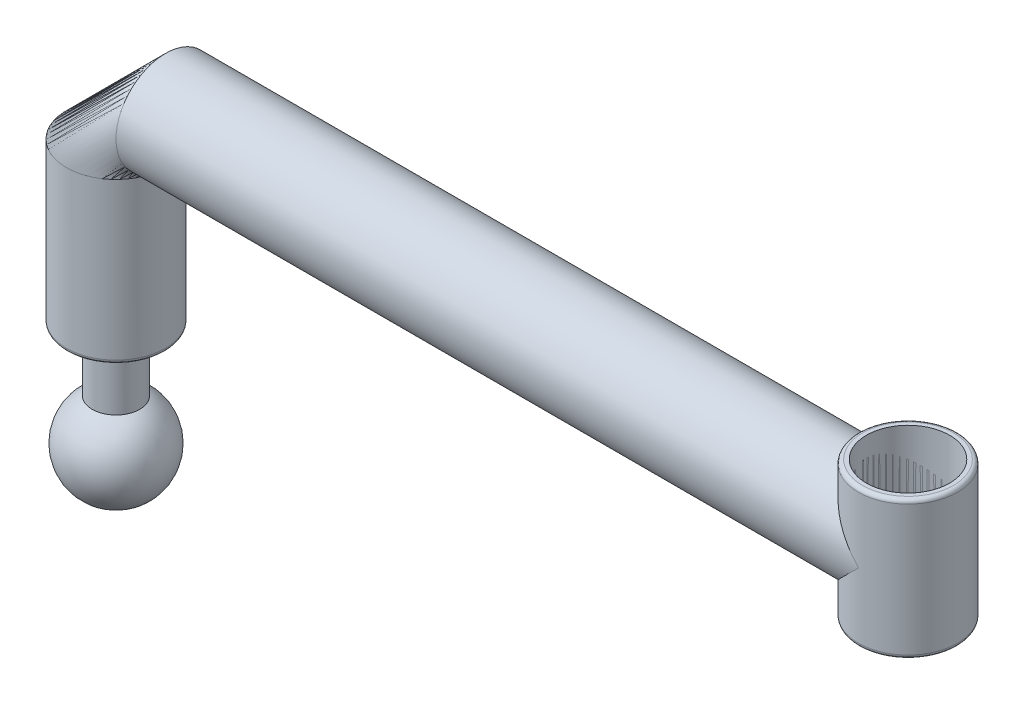
ISO-10303-21;
HEADER;
FILE_DESCRIPTION(('STEP AP214'),'2;1');
FILE_NAME('part.step','',(''),(''),'','','');
FILE_SCHEMA(('AUTOMOTIVE_DESIGN { 1 0 10303 214 1 1 1 1 }'));
ENDSEC;
DATA;
#1=APPLICATION_CONTEXT('core data for automotive mechanical design processes');
#2=APPLICATION_PROTOCOL_DEFINITION('international standard','automotive_design',2000,#1);
#3=PRODUCT_CONTEXT('',#1,'mechanical');
#4=PRODUCT('Part','Part','',(#3));
#5=PRODUCT_RELATED_PRODUCT_CATEGORY('part','',(#4));
#6=PRODUCT_DEFINITION_FORMATION('','',#4);
#7=PRODUCT_DEFINITION_CONTEXT('part definition',#1,'design');
#8=PRODUCT_DEFINITION('design','',#6,#7);
#9=PRODUCT_DEFINITION_SHAPE('','',#8);
#10=(LENGTH_UNIT() NAMED_UNIT(*) SI_UNIT(.MILLI.,.METRE.));
#11=(NAMED_UNIT(*) PLANE_ANGLE_UNIT() SI_UNIT($,.RADIAN.));
#12=(NAMED_UNIT(*) SI_UNIT($,.STERADIAN.) SOLID_ANGLE_UNIT());
#13=UNCERTAINTY_MEASURE_WITH_UNIT(LENGTH_MEASURE(1.E-05),#10,'distance_accuracy_value','');
#14=(GEOMETRIC_REPRESENTATION_CONTEXT(3) GLOBAL_UNCERTAINTY_ASSIGNED_CONTEXT((#13)) GLOBAL_UNIT_ASSIGNED_CONTEXT((#10,
#11,#12)) REPRESENTATION_CONTEXT('',''));
#15=CARTESIAN_POINT('',(0.,0.,0.));
#16=DIRECTION('',(0.,0.,1.));
#17=DIRECTION('',(1.,0.,0.));
#18=AXIS2_PLACEMENT_3D('',#15,#16,#17);
#19=CARTESIAN_POINT('',(200.,79.,0.));
#20=DIRECTION('',(0.,1.,0.));
#21=DIRECTION('',(0.,0.,1.));
#22=AXIS2_PLACEMENT_3D('',#19,#20,#21);
#23=CYLINDRICAL_SURFACE('',#22,12.5);
#24=CARTESIAN_POINT('',(200.,95.5,0.));
#25=DIRECTION('',(0.,1.,0.));
#26=DIRECTION('',(0.,0.,1.));
#27=AXIS2_PLACEMENT_3D('',#24,#25,#26);
#28=CIRCLE('',#27,12.5);
#29=CARTESIAN_POINT('',(200.,95.5,12.5));
#30=VERTEX_POINT('',#29);
#31=EDGE_CURVE('E48',#30,#30,#28,.F.);
#32=ORIENTED_EDGE('',*,*,#31,.T.);
#33=EDGE_LOOP('',(#32));
#34=FACE_BOUND('',#33,.T.);
#35=CARTESIAN_POINT('',(200.,62.5,0.));
#36=DIRECTION('',(0.,1.,0.));
#37=DIRECTION('',(0.,0.,1.));
#38=AXIS2_PLACEMENT_3D('',#35,#36,#37);
#39=CIRCLE('',#38,12.5);
#40=CARTESIAN_POINT('',(200.,62.5,12.5));
#41=VERTEX_POINT('',#40);
#42=EDGE_CURVE('E52',#41,#41,#39,.T.);
#43=ORIENTED_EDGE('',*,*,#42,.T.);
#44=EDGE_LOOP('',(#43));
#45=FACE_BOUND('',#44,.T.);
#46=ADVANCED_FACE('F41',(#34,#45),#23,.T.);
#47=CARTESIAN_POINT('',(200.,61.5,0.));
#48=DIRECTION('',(0.,1.,0.));
#49=DIRECTION('',(0.,0.,1.));
#50=AXIS2_PLACEMENT_3D('',#47,#48,#49);
#51=PLANE('',#50);
#52=CARTESIAN_POINT('',(200.,61.5,0.));
#53=DIRECTION('',(0.,1.,0.));
#54=DIRECTION('',(0.,0.,1.));
#55=AXIS2_PLACEMENT_3D('',#52,#53,#54);
#56=CIRCLE('',#55,11.5);
#57=CARTESIAN_POINT('',(200.,61.5,11.5));
#58=VERTEX_POINT('',#57);
#59=EDGE_CURVE('E11',#58,#58,#56,.F.);
#60=ORIENTED_EDGE('',*,*,#59,.T.);
#61=EDGE_LOOP('',(#60));
#62=FACE_BOUND('',#61,.T.);
#63=ADVANCED_FACE('F81',(#62),#51,.F.);
#64=CARTESIAN_POINT('',(200.,96.5,0.));
#65=DIRECTION('',(0.,1.,0.));
#66=DIRECTION('',(0.,0.,1.));
#67=AXIS2_PLACEMENT_3D('',#64,#65,#66);
#68=PLANE('',#67);
#69=CARTESIAN_POINT('',(200.,96.5,0.));
#70=DIRECTION('',(0.,1.,0.));
#71=DIRECTION('',(0.,0.,1.));
#72=AXIS2_PLACEMENT_3D('',#69,#70,#71);
#73=CIRCLE('',#72,11.5);
#74=CARTESIAN_POINT('',(200.,96.5,11.5));
#75=VERTEX_POINT('',#74);
#76=EDGE_CURVE('E56',#75,#75,#73,.T.);
#77=ORIENTED_EDGE('',*,*,#76,.T.);
#78=EDGE_LOOP('',(#77));
#79=FACE_BOUND('',#78,.T.);
#80=CARTESIAN_POINT('',(200.,96.5,0.));
#81=DIRECTION('',(0.,1.,0.));
#82=DIRECTION('',(0.,0.,1.));
#83=AXIS2_PLACEMENT_3D('',#80,#81,#82);
#84=CIRCLE('',#83,10.5);
#85=CARTESIAN_POINT('',(200.,96.5,10.5));
#86=VERTEX_POINT('',#85);
#87=EDGE_CURVE('E62',#86,#86,#84,.T.);
#88=ORIENTED_EDGE('',*,*,#87,.F.);
#89=EDGE_LOOP('',(#88));
#90=FACE_BOUND('',#89,.T.);
#91=ADVANCED_FACE('F72',(#79,#90),#68,.T.);
#92=CARTESIAN_POINT('',(200.,79.,0.));
#93=DIRECTION('',(0.,1.,0.));
#94=DIRECTION('',(0.,0.,1.));
#95=AXIS2_PLACEMENT_3D('',#92,#93,#94);
#96=CYLINDRICAL_SURFACE('',#95,10.5);
#97=ORIENTED_EDGE('',*,*,#87,.T.);
#98=EDGE_LOOP('',(#97));
#99=FACE_BOUND('',#98,.T.);
#100=CARTESIAN_POINT('',(200.,63.5,0.));
#101=DIRECTION('',(0.,1.,0.));
#102=DIRECTION('',(0.,0.,1.));
#103=AXIS2_PLACEMENT_3D('',#100,#101,#102);
#104=CIRCLE('',#103,10.5);
#105=CARTESIAN_POINT('',(200.,63.5,10.5));
#106=VERTEX_POINT('',#105);
#107=EDGE_CURVE('E61',#106,#106,#104,.T.);
#108=ORIENTED_EDGE('',*,*,#107,.F.);
#109=EDGE_LOOP('',(#108));
#110=FACE_BOUND('',#109,.T.);
#111=ADVANCED_FACE('F70',(#99,#110),#96,.F.);
#112=CARTESIAN_POINT('',(200.,63.5,0.));
#113=DIRECTION('',(0.,1.,0.));
#114=DIRECTION('',(0.,0.,1.));
#115=AXIS2_PLACEMENT_3D('',#112,#113,#114);
#116=PLANE('',#115);
#117=ORIENTED_EDGE('',*,*,#107,.T.);
#118=EDGE_LOOP('',(#117));
#119=FACE_BOUND('',#118,.T.);
#120=ADVANCED_FACE('F68',(#119),#116,.T.);
#121=CARTESIAN_POINT('',(200.,95.5,0.));
#122=DIRECTION('',(0.,1.,0.));
#123=DIRECTION('',(0.,0.,1.));
#124=AXIS2_PLACEMENT_3D('',#121,#122,#123);
#125=TOROIDAL_SURFACE('',#124,11.5,1.);
#126=ORIENTED_EDGE('',*,*,#31,.F.);
#127=EDGE_LOOP('',(#126));
#128=FACE_BOUND('',#127,.T.);
#129=ORIENTED_EDGE('',*,*,#76,.F.);
#130=EDGE_LOOP('',(#129));
#131=FACE_BOUND('',#130,.T.);
#132=ADVANCED_FACE('F79',(#128,#131),#125,.T.);
#133=CARTESIAN_POINT('',(200.,62.5,0.));
#134=DIRECTION('',(0.,1.,0.));
#135=DIRECTION('',(0.,0.,1.));
#136=AXIS2_PLACEMENT_3D('',#133,#134,#135);
#137=TOROIDAL_SURFACE('',#136,11.5,1.);
#138=ORIENTED_EDGE('',*,*,#59,.F.);
#139=EDGE_LOOP('',(#138));
#140=FACE_BOUND('',#139,.T.);
#141=ORIENTED_EDGE('',*,*,#42,.F.);
#142=EDGE_LOOP('',(#141));
#143=FACE_BOUND('',#142,.T.);
#144=ADVANCED_FACE('F43',(#140,#143),#137,.T.);
#145=CLOSED_SHELL('',(#46,#63,#91,#111,#120,#132,#144));
#146=MANIFOLD_SOLID_BREP('B2',#145);
#147=CARTESIAN_POINT('',(12.5,79.,0.));
#148=DIRECTION('',(1.,0.,0.));
#149=DIRECTION('',(0.,1.,0.));
#150=AXIS2_PLACEMENT_3D('',#147,#148,#149);
#151=CYLINDRICAL_SURFACE('',#150,12.5);
#152=CARTESIAN_POINT('',(12.5,79.,0.));
#153=DIRECTION('',(1.,0.,0.));
#154=DIRECTION('',(0.,0.,1.));
#155=AXIS2_PLACEMENT_3D('',#152,#153,#154);
#156=CIRCLE('',#155,12.5);
#157=CARTESIAN_POINT('',(12.5,66.5,0.));
#158=VERTEX_POINT('',#157);
#159=EDGE_CURVE('E175',#158,#158,#156,.T.);
#160=ORIENTED_EDGE('',*,*,#159,.T.);
#161=EDGE_LOOP('',(#160));
#162=FACE_BOUND('',#161,.T.);
#163=CARTESIAN_POINT('',(200.,79.,0.));
#164=DIRECTION('',(1.,0.,0.));
#165=DIRECTION('',(0.,0.,1.));
#166=AXIS2_PLACEMENT_3D('',#163,#164,#165);
#167=CIRCLE('',#166,12.5);
#168=CARTESIAN_POINT('',(200.,85.7823299831253,10.5));
#169=VERTEX_POINT('',#168);
#170=CARTESIAN_POINT('',(200.,72.2176700168747,10.5));
#171=VERTEX_POINT('',#170);
#172=EDGE_CURVE('E197',#169,#171,#167,.T.);
#173=ORIENTED_EDGE('',*,*,#172,.F.);
#174=CARTESIAN_POINT('',(200.,85.7823299831253,10.5));
#175=CARTESIAN_POINT('',(199.814885205617,85.782193180428,10.5000442332341));
#176=CARTESIAN_POINT('',(199.629856733377,85.7899052341444,10.4951067566132));
#177=CARTESIAN_POINT('',(199.261856361922,85.819955079881,10.4756276433661));
#178=CARTESIAN_POINT('',(199.078881116329,85.8422638854892,10.4611050405055));
#179=CARTESIAN_POINT('',(198.718838827384,85.9000079522535,10.4230987372453));
#180=CARTESIAN_POINT('',(198.541724349192,85.9352419032979,10.3997523079862));
#181=CARTESIAN_POINT('',(198.191471786911,86.0172491823179,10.3445961397331));
#182=CARTESIAN_POINT('',(198.018336019377,86.0640290555576,10.3127815994496));
#183=CARTESIAN_POINT('',(197.60744750279,86.188317901981,10.2267227372609));
#184=CARTESIAN_POINT('',(197.37194602549,86.2705969529485,10.1686137320892));
#185=CARTESIAN_POINT('',(196.910690964536,86.4497372754314,10.038111887757));
#186=CARTESIAN_POINT('',(196.684941460615,86.5466045753446,9.96571313969267));
#187=CARTESIAN_POINT('',(196.241308004862,86.7516941553662,9.80704733920059));
#188=CARTESIAN_POINT('',(196.02350277046,86.8600022209004,9.72067248879942));
#189=CARTESIAN_POINT('',(195.597354826906,87.0839630138115,9.53523498390806));
#190=CARTESIAN_POINT('',(195.3890118789,87.1996155556161,9.43617264992753));
#191=CARTESIAN_POINT('',(194.887110776819,87.4901352876558,9.17719606195867));
#192=CARTESIAN_POINT('',(194.598667704552,87.6676676625636,9.01031675898407));
#193=CARTESIAN_POINT('',(194.040267705488,88.0262236202439,8.65111612089593));
#194=CARTESIAN_POINT('',(193.770318953924,88.2072487021945,8.45878364318725));
#195=CARTESIAN_POINT('',(193.24965590904,88.5672300440078,8.04936428722044));
#196=CARTESIAN_POINT('',(192.998899832416,88.7461900333905,7.83233389864206));
#197=CARTESIAN_POINT('',(192.516916710327,89.0979922474473,7.37320554012316));
#198=CARTESIAN_POINT('',(192.28568209758,89.2708368274596,7.13111736532233));
#199=CARTESIAN_POINT('',(191.891736661237,89.5703029000156,6.67653124005511));
#200=CARTESIAN_POINT('',(191.724968775967,89.698884684649,6.46882987606101));
#201=CARTESIAN_POINT('',(191.40563794558,89.947741601771,6.038111013956));
#202=CARTESIAN_POINT('',(191.253072078535,90.0680184416007,5.81509668281913));
#203=CARTESIAN_POINT('',(190.963667862747,90.2981242364519,5.35431072159252));
#204=CARTESIAN_POINT('',(190.82681384427,90.4079635818117,5.11655416526484));
#205=CARTESIAN_POINT('',(190.570293647401,90.6152336261375,4.62677125983083));
#206=CARTESIAN_POINT('',(190.45062429294,90.7126666176678,4.37474755961391));
#207=CARTESIAN_POINT('',(190.249545596832,90.8772319942023,3.90287144506472));
#208=CARTESIAN_POINT('',(190.165106143115,90.9466825591916,3.68511523057034));
#209=CARTESIAN_POINT('',(190.010140829549,91.0745753719777,3.24158437420788));
#210=CARTESIAN_POINT('',(189.939612122718,91.1330198721703,3.0158113842417));
#211=CARTESIAN_POINT('',(189.813451781201,91.2378320058248,2.55748017122396));
#212=CARTESIAN_POINT('',(189.75781446354,91.2842042462169,2.32492457428894));
#213=CARTESIAN_POINT('',(189.662261954042,91.363985436966,1.85439897645519));
#214=CARTESIAN_POINT('',(189.622346941837,91.3973942392126,1.61642891372781));
#215=CARTESIAN_POINT('',(189.558776412443,91.4506564846933,1.1357295663736));
#216=CARTESIAN_POINT('',(189.535193540784,91.470449361581,0.892983895261466));
#217=CARTESIAN_POINT('',(189.505001119972,91.4957966489631,0.40569240813472));
#218=CARTESIAN_POINT('',(189.498391606355,91.5013510296454,0.161146588352096));
#219=CARTESIAN_POINT('',(189.502268909698,91.4980941394414,-0.327703599798565));
#220=CARTESIAN_POINT('',(189.512755167141,91.4892833387026,-0.572007975806798));
#221=CARTESIAN_POINT('',(189.55062870629,91.4574979132207,-1.05836166600747));
#222=CARTESIAN_POINT('',(189.578015366191,91.4345238095786,-1.30041106283326));
#223=CARTESIAN_POINT('',(189.646694285016,91.3770196093765,-1.76350769028458));
#224=CARTESIAN_POINT('',(189.686875826675,91.3434136124542,-1.98483674969008));
#225=CARTESIAN_POINT('',(189.780852364054,91.2650033551163,-2.42263580912784));
#226=CARTESIAN_POINT('',(189.834651985973,91.2201952893078,-2.63910413065678));
#227=CARTESIAN_POINT('',(189.955121763842,91.120167178795,-3.06587219927859));
#228=CARTESIAN_POINT('',(190.021787854774,91.064950422728,-3.27617387054587));
#229=CARTESIAN_POINT('',(190.167228408901,90.9449449665074,-3.68980943507554));
#230=CARTESIAN_POINT('',(190.246007371043,90.880152710183,-3.89314070494315));
#231=CARTESIAN_POINT('',(190.421820321931,90.7362159575581,-4.30853186015647));
#232=CARTESIAN_POINT('',(190.519825106437,90.6563277355549,-4.51992345006376));
#233=CARTESIAN_POINT('',(190.728025794977,90.4876368303903,-4.93295464209273));
#234=CARTESIAN_POINT('',(190.838226532202,90.3988306143752,-5.13459033218102));
#235=CARTESIAN_POINT('',(191.185755796388,90.1207660340041,-5.7242646210157));
#236=CARTESIAN_POINT('',(191.440015536837,89.9198582951669,-6.09708011302796));
#237=CARTESIAN_POINT('',(191.916178482036,89.5513841964725,-6.70903957511248));
#238=CARTESIAN_POINT('',(192.129565666706,89.3885459167494,-6.95789057769455));
#239=CARTESIAN_POINT('',(192.575664395339,89.0547900980201,-7.43203688918888));
#240=CARTESIAN_POINT('',(192.80838477252,88.8838688815024,-7.65732132329619));
#241=CARTESIAN_POINT('',(193.292187386915,88.5376164918639,-8.08453073554504));
#242=CARTESIAN_POINT('',(193.543301467029,88.3622780330893,-8.28641356316498));
#243=CARTESIAN_POINT('',(194.062948563508,88.0117535988053,-8.66631370159407));
#244=CARTESIAN_POINT('',(194.33147550748,87.8365675915005,-8.84433926644332));
#245=CARTESIAN_POINT('',(194.815993328975,87.5350863985561,-9.13423908238507));
#246=CARTESIAN_POINT('',(195.028086456827,87.4076359044956,-9.25145402332138));
#247=CARTESIAN_POINT('',(195.46251995012,87.1582497195758,-9.47209888472012));
#248=CARTESIAN_POINT('',(195.684861237864,87.0363145270404,-9.57552756118957));
#249=CARTESIAN_POINT('',(196.139783254265,86.8015021581271,-9.76778039727052));
#250=CARTESIAN_POINT('',(196.372341038464,86.6886061454676,-9.85663535437518));
#251=CARTESIAN_POINT('',(196.848331816502,86.4758020743936,-10.0189960414343));
#252=CARTESIAN_POINT('',(197.091758821258,86.3758869791463,-10.0925101007587));
#253=CARTESIAN_POINT('',(197.675266387203,86.1629565064911,-10.245226449321));
#254=CARTESIAN_POINT('',(198.01994049215,86.0571392143798,-10.3177821436954));
#255=CARTESIAN_POINT('',(198.548530088416,85.9337877182072,-10.400722651591));
#256=CARTESIAN_POINT('',(198.726419417545,85.8985890033978,-10.4240405152386));
#257=CARTESIAN_POINT('',(199.085225604061,85.8414582107173,-10.4616268813035));
#258=CARTESIAN_POINT('',(199.266140267968,85.8195169157197,-10.4759016711887));
#259=CARTESIAN_POINT('',(199.539564012411,85.7973240378339,-10.4903029392079));
#260=CARTESIAN_POINT('',(199.631491352423,85.7917122186972,-10.4939351534233));
#261=CARTESIAN_POINT('',(199.815607065695,85.7842113279546,-10.4987850096603));
#262=CARTESIAN_POINT('',(199.907795546544,85.7823241203401,-10.5000014427));
#263=CARTESIAN_POINT('',(200.,85.7823299831253,-10.5));
#264=B_SPLINE_CURVE_WITH_KNOTS('',3,(#174,#175,#176,#177,#178,#179,#180,#181,#182,#183,#184,
#185,#186,#187,#188,#189,#190,#191,#192,#193,#194,#195,#196,#197,#198,#199,#200,#201,#202,#203,
#204,#205,#206,#207,#208,#209,#210,#211,#212,#213,#214,#215,#216,#217,#218,#219,#220,#221,#222,
#223,#224,#225,#226,#227,#228,#229,#230,#231,#232,#233,#234,#235,#236,#237,#238,#239,#240,#241,
#242,#243,#244,#245,#246,#247,#248,#249,#250,#251,#252,#253,#254,#255,#256,#257,#258,#259,#260,
#261,#262,#263),.UNSPECIFIED.,.F.,.F.,(4,2,2,2,2,2,2,2,2,2,2,2,2,2,2,2,2,2,2,2,2,2,2,2,2,2,2,2,
2,2,2,2,2,2,2,2,2,2,2,2,2,2,2,2,4),(0.,0.554980096775673,1.10886143838458,1.6544588998956,
2.20036636823339,2.96752907031004,3.73500966638734,4.50871984128991,5.28241047467416,
6.41365399013668,7.54539437659988,8.67459636103864,9.80335859329763,10.6899230369954,
11.5763046736337,12.4617944808919,13.347120420698,14.0773888144323,14.807507595642,
15.5373473443154,16.2671954313313,17.0002693927083,17.7333448889688,18.4663963934172,
19.1994209288066,19.8810044181332,20.5628197597931,21.2444200411053,21.9262740957576,
22.6645040732851,23.403027662217,24.8800418925178,25.9768925324394,27.0742471024238,
28.1735484638785,29.2724685061024,30.0933455155178,30.914296546068,31.7334897275766,
32.552236962618,33.6508758552681,34.1987832995794,34.7463093755222,35.0227262274729,
35.2992813779064),.UNSPECIFIED.);
#265=CARTESIAN_POINT('',(200.,85.7823299831253,-10.5));
#266=VERTEX_POINT('',#265);
#267=EDGE_CURVE('E186',#169,#266,#264,.T.);
#268=ORIENTED_EDGE('',*,*,#267,.T.);
#269=CARTESIAN_POINT('',(200.,72.2176700168747,-10.5));
#270=VERTEX_POINT('',#269);
#271=EDGE_CURVE('E192',#270,#266,#167,.T.);
#272=ORIENTED_EDGE('',*,*,#271,.F.);
#273=CARTESIAN_POINT('',(200.,72.2176700168747,-10.5));
#274=CARTESIAN_POINT('',(199.814885205617,72.217806819572,-10.5000442332341));
#275=CARTESIAN_POINT('',(199.629856733377,72.2100947658556,-10.4951067566132));
#276=CARTESIAN_POINT('',(199.261856361922,72.180044920119,-10.4756276433661));
#277=CARTESIAN_POINT('',(199.078881116329,72.1577361145108,-10.4611050405055));
#278=CARTESIAN_POINT('',(198.718838827384,72.0999920477465,-10.4230987372453));
#279=CARTESIAN_POINT('',(198.541724349192,72.0647580967021,-10.3997523079862));
#280=CARTESIAN_POINT('',(198.191471786911,71.9827508176821,-10.3445961397331));
#281=CARTESIAN_POINT('',(198.018336019377,71.9359709444424,-10.3127815994496));
#282=CARTESIAN_POINT('',(197.60744750279,71.811682098019,-10.2267227372609));
#283=CARTESIAN_POINT('',(197.37194602549,71.7294030470515,-10.1686137320892));
#284=CARTESIAN_POINT('',(196.910690964536,71.5502627245687,-10.038111887757));
#285=CARTESIAN_POINT('',(196.684941460615,71.4533954246554,-9.96571313969267));
#286=CARTESIAN_POINT('',(196.241308004862,71.2483058446338,-9.80704733920059));
#287=CARTESIAN_POINT('',(196.02350277046,71.1399977790996,-9.72067248879942));
#288=CARTESIAN_POINT('',(195.597354826906,70.9160369861885,-9.53523498390806));
#289=CARTESIAN_POINT('',(195.3890118789,70.8003844443839,-9.43617264992754));
#290=CARTESIAN_POINT('',(194.887110776819,70.5098647123442,-9.17719606195867));
#291=CARTESIAN_POINT('',(194.598667704552,70.3323323374364,-9.01031675898407));
#292=CARTESIAN_POINT('',(194.040267705488,69.9737763797561,-8.65111612089593));
#293=CARTESIAN_POINT('',(193.770318953924,69.7927512978055,-8.45878364318725));
#294=CARTESIAN_POINT('',(193.24965590904,69.4327699559922,-8.04936428722044));
#295=CARTESIAN_POINT('',(192.998899832416,69.2538099666095,-7.83233389864206));
#296=CARTESIAN_POINT('',(192.516916710327,68.9020077525527,-7.37320554012316));
#297=CARTESIAN_POINT('',(192.28568209758,68.7291631725404,-7.13111736532233));
#298=CARTESIAN_POINT('',(191.891736661237,68.4296970999844,-6.6765312400551));
#299=CARTESIAN_POINT('',(191.724968775967,68.301115315351,-6.468829876061));
#300=CARTESIAN_POINT('',(191.40563794558,68.0522583982289,-6.03811101395598));
#301=CARTESIAN_POINT('',(191.253072078535,67.9319815583993,-5.81509668281912));
#302=CARTESIAN_POINT('',(190.963667862747,67.7018757635481,-5.35431072159251));
#303=CARTESIAN_POINT('',(190.82681384427,67.5920364181883,-5.11655416526483));
#304=CARTESIAN_POINT('',(190.570293647401,67.3847663738625,-4.62677125983082));
#305=CARTESIAN_POINT('',(190.45062429294,67.2873333823322,-4.3747475596139));
#306=CARTESIAN_POINT('',(190.249545596832,67.1227680057977,-3.90287144506472));
#307=CARTESIAN_POINT('',(190.165106143115,67.0533174408084,-3.68511523057034));
#308=CARTESIAN_POINT('',(190.010140829549,66.9254246280223,-3.24158437420788));
#309=CARTESIAN_POINT('',(189.939612122718,66.8669801278297,-3.0158113842417));
#310=CARTESIAN_POINT('',(189.813451781201,66.7621679941752,-2.55748017122396));
#311=CARTESIAN_POINT('',(189.75781446354,66.7157957537831,-2.32492457428894));
#312=CARTESIAN_POINT('',(189.662261954042,66.636014563034,-1.85439897645519));
#313=CARTESIAN_POINT('',(189.622346941837,66.6026057607874,-1.61642891372781));
#314=CARTESIAN_POINT('',(189.558776412443,66.5493435153067,-1.1357295663736));
#315=CARTESIAN_POINT('',(189.535193540784,66.529550638419,-0.892983895261465));
#316=CARTESIAN_POINT('',(189.505001119972,66.5042033510369,-0.40569240813472));
#317=CARTESIAN_POINT('',(189.498391606355,66.4986489703546,-0.161146588352096));
#318=CARTESIAN_POINT('',(189.502268909698,66.5019058605586,0.327703599798565));
#319=CARTESIAN_POINT('',(189.512755167141,66.5107166612975,0.572007975806798));
#320=CARTESIAN_POINT('',(189.55062870629,66.5425020867793,1.05836166600747));
#321=CARTESIAN_POINT('',(189.578015366191,66.5654761904214,1.30041106283326));
#322=CARTESIAN_POINT('',(189.646694285016,66.6229803906235,1.76350769028458));
#323=CARTESIAN_POINT('',(189.686875826675,66.6565863875458,1.98483674969009));
#324=CARTESIAN_POINT('',(189.780852364054,66.7349966448837,2.42263580912785));
#325=CARTESIAN_POINT('',(189.834651985973,66.7798047106922,2.63910413065679));
#326=CARTESIAN_POINT('',(189.955121763842,66.879832821205,3.06587219927859));
#327=CARTESIAN_POINT('',(190.021787854774,66.935049577272,3.27617387054587));
#328=CARTESIAN_POINT('',(190.167228408901,67.0550550334926,3.68980943507554));
#329=CARTESIAN_POINT('',(190.246007371043,67.119847289817,3.89314070494315));
#330=CARTESIAN_POINT('',(190.421820321931,67.2637840424419,4.30853186015648));
#331=CARTESIAN_POINT('',(190.519825106437,67.3436722644451,4.51992345006376));
#332=CARTESIAN_POINT('',(190.728025794977,67.5123631696097,4.93295464209274));
#333=CARTESIAN_POINT('',(190.838226532202,67.6011693856248,5.13459033218102));
#334=CARTESIAN_POINT('',(191.185755796388,67.8792339659959,5.7242646210157));
#335=CARTESIAN_POINT('',(191.440015536837,68.0801417048331,6.09708011302796));
#336=CARTESIAN_POINT('',(191.916178482036,68.4486158035275,6.70903957511248));
#337=CARTESIAN_POINT('',(192.129565666706,68.6114540832506,6.95789057769455));
#338=CARTESIAN_POINT('',(192.575664395339,68.9452099019799,7.43203688918888));
#339=CARTESIAN_POINT('',(192.80838477252,69.1161311184976,7.65732132329619));
#340=CARTESIAN_POINT('',(193.292187386915,69.4623835081361,8.08453073554504));
#341=CARTESIAN_POINT('',(193.543301467029,69.6377219669107,8.28641356316498));
#342=CARTESIAN_POINT('',(194.062948563508,69.9882464011947,8.66631370159407));
#343=CARTESIAN_POINT('',(194.33147550748,70.1634324084995,8.84433926644332));
#344=CARTESIAN_POINT('',(194.815993328975,70.4649136014439,9.13423908238507));
#345=CARTESIAN_POINT('',(195.028086456827,70.5923640955044,9.25145402332138));
#346=CARTESIAN_POINT('',(195.46251995012,70.8417502804242,9.47209888472012));
#347=CARTESIAN_POINT('',(195.684861237864,70.9636854729596,9.57552756118957));
#348=CARTESIAN_POINT('',(196.139783254265,71.1984978418729,9.76778039727052));
#349=CARTESIAN_POINT('',(196.372341038463,71.3113938545325,9.85663535437518));
#350=CARTESIAN_POINT('',(196.848331816502,71.5241979256064,10.0189960414343));
#351=CARTESIAN_POINT('',(197.091758821258,71.6241130208537,10.0925101007587));
#352=CARTESIAN_POINT('',(197.675266387203,71.8370434935089,10.245226449321));
#353=CARTESIAN_POINT('',(198.01994049215,71.9428607856202,10.3177821436954));
#354=CARTESIAN_POINT('',(198.548530088416,72.0662122817928,10.400722651591));
#355=CARTESIAN_POINT('',(198.726419417545,72.1014109966022,10.4240405152386));
#356=CARTESIAN_POINT('',(199.085225604061,72.1585417892827,10.4616268813035));
#357=CARTESIAN_POINT('',(199.266140267968,72.1804830842803,10.4759016711887));
#358=CARTESIAN_POINT('',(199.539564012411,72.2026759621661,10.4903029392079));
#359=CARTESIAN_POINT('',(199.631491352423,72.2082877813028,10.4939351534233));
#360=CARTESIAN_POINT('',(199.815607065695,72.2157886720454,10.4987850096603));
#361=CARTESIAN_POINT('',(199.907795546544,72.2176758796599,10.5000014427));
#362=CARTESIAN_POINT('',(200.,72.2176700168747,10.5));
#363=B_SPLINE_CURVE_WITH_KNOTS('',3,(#273,#274,#275,#276,#277,#278,#279,#280,#281,#282,#283,
#284,#285,#286,#287,#288,#289,#290,#291,#292,#293,#294,#295,#296,#297,#298,#299,#300,#301,#302,
#303,#304,#305,#306,#307,#308,#309,#310,#311,#312,#313,#314,#315,#316,#317,#318,#319,#320,#321,
#322,#323,#324,#325,#326,#327,#328,#329,#330,#331,#332,#333,#334,#335,#336,#337,#338,#339,#340,
#341,#342,#343,#344,#345,#346,#347,#348,#349,#350,#351,#352,#353,#354,#355,#356,#357,#358,#359,
#360,#361,#362),.UNSPECIFIED.,.F.,.F.,(4,2,2,2,2,2,2,2,2,2,2,2,2,2,2,2,2,2,2,2,2,2,2,2,2,2,2,2,
2,2,2,2,2,2,2,2,2,2,2,2,2,2,2,2,4),(0.,0.554980096775673,1.10886143838458,1.6544588998956,
2.20036636823339,2.96752907031004,3.73500966638734,4.50871984128988,5.28241047467416,
6.41365399013668,7.54539437659988,8.67459636103864,9.80335859329763,10.6899230369954,
11.5763046736337,12.4617944808919,13.347120420698,14.0773888144323,14.807507595642,
15.5373473443154,16.2671954313313,17.0002693927083,17.7333448889688,18.4663963934172,
19.1994209288066,19.8810044181332,20.5628197597931,21.2444200411053,21.9262740957576,
22.6645040732852,23.4030276622171,24.8800418925178,25.9768925324394,27.0742471024239,
28.1735484638785,29.2724685061024,30.0933455155178,30.914296546068,31.7334897275766,
32.552236962618,33.6508758552681,34.1987832995794,34.7463093755223,35.0227262274729,
35.2992813779064),.UNSPECIFIED.);
#364=EDGE_CURVE('E169',#270,#171,#363,.T.);
#365=ORIENTED_EDGE('',*,*,#364,.T.);
#366=EDGE_LOOP('',(#173,#268,#272,#365));
#367=FACE_BOUND('',#366,.T.);
#368=ADVANCED_FACE('F154',(#162,#367),#151,.T.);
#369=CARTESIAN_POINT('',(200.,79.,0.));
#370=DIRECTION('',(1.,0.,0.));
#371=DIRECTION('',(0.,0.,1.));
#372=AXIS2_PLACEMENT_3D('',#369,#370,#371);
#373=PLANE('',#372);
#374=ORIENTED_EDGE('',*,*,#172,.T.);
#375=DIRECTION('',(0.,-1.,0.));
#376=VECTOR('',#375,1.);
#377=CARTESIAN_POINT('',(200.,96.5,10.5));
#378=LINE('',#377,#376);
#379=EDGE_CURVE('E191',#171,#169,#378,.F.);
#380=ORIENTED_EDGE('',*,*,#379,.T.);
#381=EDGE_LOOP('',(#374,#380));
#382=FACE_BOUND('',#381,.T.);
#383=ADVANCED_FACE('F220',(#382),#373,.T.);
#384=ORIENTED_EDGE('',*,*,#271,.T.);
#385=DIRECTION('',(0.,-1.,0.));
#386=VECTOR('',#385,1.);
#387=CARTESIAN_POINT('',(200.,96.5,-10.5));
#388=LINE('',#387,#386);
#389=EDGE_CURVE('E183',#266,#270,#388,.T.);
#390=ORIENTED_EDGE('',*,*,#389,.T.);
#391=EDGE_LOOP('',(#384,#390));
#392=FACE_BOUND('',#391,.T.);
#393=ADVANCED_FACE('F200',(#392),#373,.T.);
#394=CARTESIAN_POINT('',(12.5,66.5,0.));
#395=DIRECTION('',(0.,0.,-1.));
#396=DIRECTION('',(-1.,0.,0.));
#397=AXIS2_PLACEMENT_3D('',#394,#395,#396);
#398=DEGENERATE_TOROIDAL_SURFACE('',#397,12.5,12.5,.T.);
#399=CARTESIAN_POINT('',(0.,66.5,0.));
#400=DIRECTION('',(0.,1.,0.));
#401=DIRECTION('',(0.,0.,1.));
#402=AXIS2_PLACEMENT_3D('',#399,#400,#401);
#403=CIRCLE('',#402,12.5);
#404=EDGE_CURVE('E198',#158,#158,#403,.T.);
#405=ORIENTED_EDGE('',*,*,#404,.T.);
#406=ORIENTED_EDGE('',*,*,#159,.F.);
#407=EDGE_LOOP('',(#405,#406));
#408=FACE_BOUND('',#407,.T.);
#409=ADVANCED_FACE('F228',(#408),#398,.T.);
#410=CARTESIAN_POINT('',(0.,66.5,0.));
#411=DIRECTION('',(0.,-1.,0.));
#412=DIRECTION('',(0.,0.,-1.));
#413=AXIS2_PLACEMENT_3D('',#410,#411,#412);
#414=CYLINDRICAL_SURFACE('',#413,12.5);
#415=CARTESIAN_POINT('',(0.,27.,0.));
#416=DIRECTION('',(0.,1.,0.));
#417=DIRECTION('',(0.,0.,1.));
#418=AXIS2_PLACEMENT_3D('',#415,#416,#417);
#419=CIRCLE('',#418,12.5);
#420=CARTESIAN_POINT('',(0.,27.,12.5));
#421=VERTEX_POINT('',#420);
#422=EDGE_CURVE('E162',#421,#421,#419,.T.);
#423=ORIENTED_EDGE('',*,*,#422,.T.);
#424=EDGE_LOOP('',(#423));
#425=FACE_BOUND('',#424,.T.);
#426=ORIENTED_EDGE('',*,*,#404,.F.);
#427=EDGE_LOOP('',(#426));
#428=FACE_BOUND('',#427,.T.);
#429=ADVANCED_FACE('F208',(#425,#428),#414,.T.);
#430=CARTESIAN_POINT('',(0.,26.,0.));
#431=DIRECTION('',(0.,1.,0.));
#432=DIRECTION('',(0.,0.,1.));
#433=AXIS2_PLACEMENT_3D('',#430,#431,#432);
#434=PLANE('',#433);
#435=CARTESIAN_POINT('',(0.,26.,0.));
#436=DIRECTION('',(0.,1.,0.));
#437=DIRECTION('',(0.,0.,1.));
#438=AXIS2_PLACEMENT_3D('',#435,#436,#437);
#439=CIRCLE('',#438,11.5);
#440=CARTESIAN_POINT('',(0.,26.,11.5));
#441=VERTEX_POINT('',#440);
#442=EDGE_CURVE('E39',#441,#441,#439,.F.);
#443=ORIENTED_EDGE('',*,*,#442,.T.);
#444=EDGE_LOOP('',(#443));
#445=FACE_BOUND('',#444,.T.);
#446=ADVANCED_FACE('F216',(#445),#434,.F.);
#447=CARTESIAN_POINT('',(200.,96.5,0.));
#448=DIRECTION('',(0.,-1.,0.));
#449=DIRECTION('',(0.,0.,-1.));
#450=AXIS2_PLACEMENT_3D('',#447,#448,#449);
#451=CYLINDRICAL_SURFACE('',#450,10.5);
#452=ORIENTED_EDGE('',*,*,#364,.F.);
#453=ORIENTED_EDGE('',*,*,#389,.F.);
#454=ORIENTED_EDGE('',*,*,#267,.F.);
#455=ORIENTED_EDGE('',*,*,#379,.F.);
#456=EDGE_LOOP('',(#452,#453,#454,#455));
#457=FACE_BOUND('',#456,.T.);
#458=ADVANCED_FACE('F185',(#457),#451,.F.);
#459=CARTESIAN_POINT('',(0.,27.,0.));
#460=DIRECTION('',(0.,1.,0.));
#461=DIRECTION('',(0.,0.,1.));
#462=AXIS2_PLACEMENT_3D('',#459,#460,#461);
#463=TOROIDAL_SURFACE('',#462,11.5,1.);
#464=ORIENTED_EDGE('',*,*,#442,.F.);
#465=EDGE_LOOP('',(#464));
#466=FACE_BOUND('',#465,.T.);
#467=ORIENTED_EDGE('',*,*,#422,.F.);
#468=EDGE_LOOP('',(#467));
#469=FACE_BOUND('',#468,.T.);
#470=ADVANCED_FACE('F156',(#466,#469),#463,.T.);
#471=CLOSED_SHELL('',(#368,#383,#393,#409,#429,#446,#458,#470));
#472=MANIFOLD_SOLID_BREP('B6',#471);
#473=CARTESIAN_POINT('',(0.,0.,0.));
#474=DIRECTION('',(0.,1.,0.));
#475=DIRECTION('',(1.,0.,0.));
#476=AXIS2_PLACEMENT_3D('',#473,#474,#475);
#477=SPHERICAL_SURFACE('',#476,12.);
#478=CARTESIAN_POINT('',(0.,10.3923048454133,0.));
#479=DIRECTION('',(0.,-1.,0.));
#480=DIRECTION('',(0.,0.,-1.));
#481=AXIS2_PLACEMENT_3D('',#478,#479,#480);
#482=CIRCLE('',#481,6.);
#483=CARTESIAN_POINT('',(0.,10.3923048454133,-6.));
#484=VERTEX_POINT('',#483);
#485=EDGE_CURVE('E153',#484,#484,#482,.F.);
#486=ORIENTED_EDGE('',*,*,#485,.F.);
#487=EDGE_LOOP('',(#486));
#488=FACE_BOUND('',#487,.T.);
#489=ADVANCED_FACE('F294',(#488),#477,.T.);
#490=CARTESIAN_POINT('',(0.,26.,0.));
#491=DIRECTION('',(0.,-1.,0.));
#492=DIRECTION('',(0.,0.,-1.));
#493=AXIS2_PLACEMENT_3D('',#490,#491,#492);
#494=CYLINDRICAL_SURFACE('',#493,6.);
#495=CARTESIAN_POINT('',(0.,26.,0.));
#496=DIRECTION('',(0.,1.,0.));
#497=DIRECTION('',(0.,0.,1.));
#498=AXIS2_PLACEMENT_3D('',#495,#496,#497);
#499=CIRCLE('',#498,6.);
#500=CARTESIAN_POINT('',(0.,26.,-6.));
#501=VERTEX_POINT('',#500);
#502=EDGE_CURVE('E300',#501,#501,#499,.T.);
#503=CARTESIAN_POINT('',(0.,26.,-6.));
#504=CARTESIAN_POINT('',(0.,25.8374198421397,-6.));
#505=CARTESIAN_POINT('',(0.,25.6748396842794,-6.));
#506=CARTESIAN_POINT('',(0.,25.3496793685589,-6.));
#507=CARTESIAN_POINT('',(0.,25.1870992106986,-6.));
#508=CARTESIAN_POINT('',(0.,24.861938894978,-6.));
#509=CARTESIAN_POINT('',(0.,24.6993587371178,-6.));
#510=CARTESIAN_POINT('',(0.,24.3741984213972,-6.));
#511=CARTESIAN_POINT('',(0.,24.2116182635369,-6.));
#512=CARTESIAN_POINT('',(0.,23.8864579478164,-6.));
#513=CARTESIAN_POINT('',(0.,23.7238777899561,-6.));
#514=CARTESIAN_POINT('',(0.,23.3987174742355,-6.));
#515=CARTESIAN_POINT('',(0.,23.2361373163753,-6.));
#516=CARTESIAN_POINT('',(0.,22.9109770006547,-6.));
#517=CARTESIAN_POINT('',(0.,22.7483968427944,-6.));
#518=CARTESIAN_POINT('',(0.,22.4232365270739,-6.));
#519=CARTESIAN_POINT('',(0.,22.2606563692136,-6.));
#520=CARTESIAN_POINT('',(0.,21.935496053493,-6.));
#521=CARTESIAN_POINT('',(0.,21.7729158956328,-6.));
#522=CARTESIAN_POINT('',(0.,21.4477555799122,-6.));
#523=CARTESIAN_POINT('',(0.,21.2851754220519,-6.));
#524=CARTESIAN_POINT('',(0.,20.9600151063314,-6.));
#525=CARTESIAN_POINT('',(0.,20.7974349484711,-6.));
#526=CARTESIAN_POINT('',(0.,20.4722746327505,-6.));
#527=CARTESIAN_POINT('',(0.,20.3096944748903,-6.));
#528=CARTESIAN_POINT('',(0.,19.9845341591697,-6.));
#529=CARTESIAN_POINT('',(0.,19.8219540013094,-6.));
#530=CARTESIAN_POINT('',(0.,19.4967936855889,-6.));
#531=CARTESIAN_POINT('',(0.,19.3342135277286,-6.));
#532=CARTESIAN_POINT('',(0.,19.009053212008,-6.));
#533=CARTESIAN_POINT('',(0.,18.8464730541477,-6.));
#534=CARTESIAN_POINT('',(0.,18.5213127384272,-6.));
#535=CARTESIAN_POINT('',(0.,18.3587325805669,-6.));
#536=CARTESIAN_POINT('',(0.,18.0335722648464,-6.));
#537=CARTESIAN_POINT('',(0.,17.8709921069861,-6.));
#538=CARTESIAN_POINT('',(0.,17.5458317912655,-6.));
#539=CARTESIAN_POINT('',(0.,17.3832516334052,-6.));
#540=CARTESIAN_POINT('',(0.,17.0580913176847,-6.));
#541=CARTESIAN_POINT('',(0.,16.8955111598244,-6.));
#542=CARTESIAN_POINT('',(0.,16.5703508441038,-6.));
#543=CARTESIAN_POINT('',(0.,16.4077706862436,-6.));
#544=CARTESIAN_POINT('',(0.,16.082610370523,-6.));
#545=CARTESIAN_POINT('',(0.,15.9200302126627,-6.));
#546=CARTESIAN_POINT('',(0.,15.5948698969422,-6.));
#547=CARTESIAN_POINT('',(0.,15.4322897390819,-6.));
#548=CARTESIAN_POINT('',(0.,15.1071294233613,-6.));
#549=CARTESIAN_POINT('',(0.,14.9445492655011,-6.));
#550=CARTESIAN_POINT('',(0.,14.6193889497805,-6.));
#551=CARTESIAN_POINT('',(0.,14.4568087919202,-6.));
#552=CARTESIAN_POINT('',(0.,14.1316484761997,-6.));
#553=CARTESIAN_POINT('',(0.,13.9690683183394,-6.));
#554=CARTESIAN_POINT('',(0.,13.6439080026188,-6.));
#555=CARTESIAN_POINT('',(0.,13.4813278447586,-6.));
#556=CARTESIAN_POINT('',(0.,13.156167529038,-6.));
#557=CARTESIAN_POINT('',(0.,12.9935873711777,-6.));
#558=CARTESIAN_POINT('',(0.,12.6684270554572,-6.));
#559=CARTESIAN_POINT('',(0.,12.5058468975969,-6.));
#560=CARTESIAN_POINT('',(0.,12.1806865818763,-6.));
#561=CARTESIAN_POINT('',(0.,12.0181064240161,-6.));
#562=CARTESIAN_POINT('',(0.,11.6929461082955,-6.));
#563=CARTESIAN_POINT('',(0.,11.5303659504352,-6.));
#564=CARTESIAN_POINT('',(0.,11.2052056347147,-6.));
#565=CARTESIAN_POINT('',(0.,11.0426254768544,-6.));
#566=CARTESIAN_POINT('',(0.,10.7174651611338,-6.));
#567=CARTESIAN_POINT('',(0.,10.5548850032735,-6.));
#568=CARTESIAN_POINT('',(0.,10.3923048454133,-6.));
#569=B_SPLINE_CURVE_WITH_KNOTS('',3,(#503,#504,#505,#506,#507,#508,#509,#510,#511,#512,#513,
#514,#515,#516,#517,#518,#519,#520,#521,#522,#523,#524,#525,#526,#527,#528,#529,#530,#531,#532,
#533,#534,#535,#536,#537,#538,#539,#540,#541,#542,#543,#544,#545,#546,#547,#548,#549,#550,#551,
#552,#553,#554,#555,#556,#557,#558,#559,#560,#561,#562,#563,#564,#565,#566,#567,#568),
.UNSPECIFIED.,.F.,.F.,(4,2,2,2,2,2,2,2,2,2,2,2,2,2,2,2,2,2,2,2,2,2,2,2,2,2,2,2,2,2,2,2,4),(0.,
0.487740473580838,0.975480947161673,1.46322142074251,1.95096189432334,2.43870236790418,
2.92644284148501,3.41418331506585,3.90192378864668,4.38966426222752,4.87740473580835,
5.36514520938919,5.85288568297002,6.34062615655086,6.8283666301317,7.31610710371253,
7.80384757729337,8.2915880508742,8.77932852445503,9.26706899803587,9.7548094716167,
10.2425499451975,10.7302904187784,11.2180308923592,11.70577136594,12.1935118395209,
12.6812523131017,13.1689927866826,13.6567332602634,14.1444737338442,14.6322142074251,
15.1199546810059,15.6076951545867),.UNSPECIFIED.);
#570=EDGE_CURVE('BSEAM308',#501,#484,#569,.T.);
#571=ORIENTED_EDGE('',*,*,#502,.F.);
#572=ORIENTED_EDGE('',*,*,#485,.T.);
#573=ORIENTED_EDGE('',*,*,#570,.T.);
#574=ORIENTED_EDGE('',*,*,#570,.F.);
#575=EDGE_LOOP('',(#571,#573,#572,#574));
#576=FACE_BOUND('',#575,.T.);
#577=ADVANCED_FACE('F308',(#576),#494,.T.);
#578=CARTESIAN_POINT('',(0.,26.,0.));
#579=DIRECTION('',(0.,1.,0.));
#580=DIRECTION('',(0.,0.,1.));
#581=AXIS2_PLACEMENT_3D('',#578,#579,#580);
#582=PLANE('',#581);
#583=ORIENTED_EDGE('',*,*,#502,.T.);
#584=EDGE_LOOP('',(#583));
#585=FACE_BOUND('',#584,.T.);
#586=ADVANCED_FACE('F306',(#585),#582,.T.);
#587=CLOSED_SHELL('',(#489,#577,#586));
#588=MANIFOLD_SOLID_BREP('B33',#587);
#589=ADVANCED_BREP_SHAPE_REPRESENTATION('',(#18,#146,#472,#588),#14);
#590=SHAPE_DEFINITION_REPRESENTATION(#9,#589);
ENDSEC;
END-ISO-10303-21;
